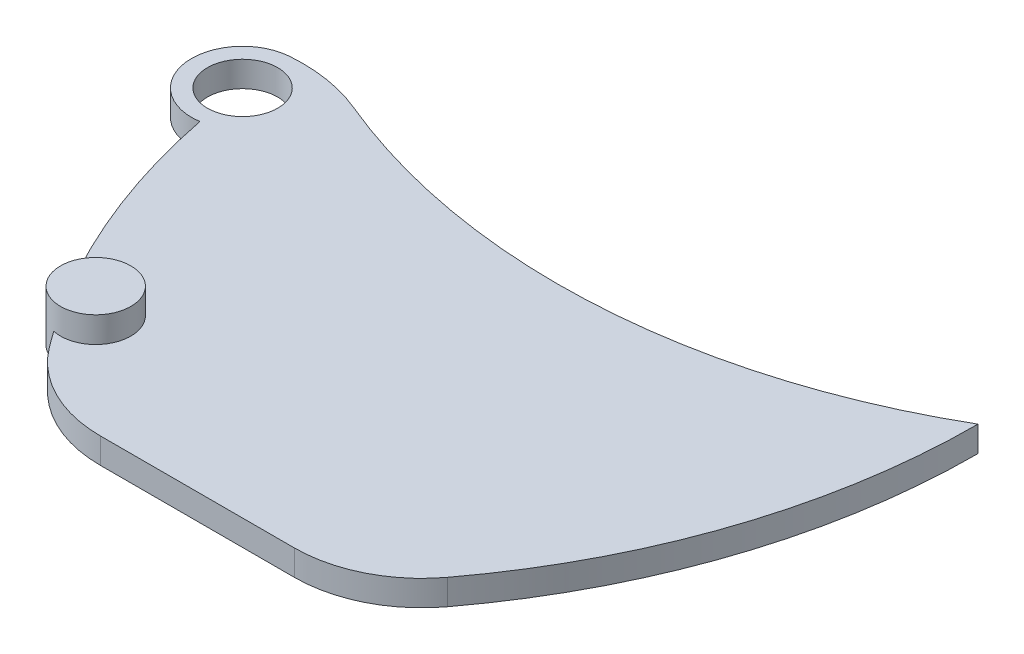
ISO-10303-21;
HEADER;
FILE_DESCRIPTION(('STEP AP214'),'2;1');
FILE_NAME('part.step','',(''),(''),'','','');
FILE_SCHEMA(('AUTOMOTIVE_DESIGN { 1 0 10303 214 1 1 1 1 }'));
ENDSEC;
DATA;
#1=APPLICATION_CONTEXT('core data for automotive mechanical design processes');
#2=APPLICATION_PROTOCOL_DEFINITION('international standard','automotive_design',2000,#1);
#3=PRODUCT_CONTEXT('',#1,'mechanical');
#4=PRODUCT('Part','Part','',(#3));
#5=PRODUCT_RELATED_PRODUCT_CATEGORY('part','',(#4));
#6=PRODUCT_DEFINITION_FORMATION('','',#4);
#7=PRODUCT_DEFINITION_CONTEXT('part definition',#1,'design');
#8=PRODUCT_DEFINITION('design','',#6,#7);
#9=PRODUCT_DEFINITION_SHAPE('','',#8);
#10=(LENGTH_UNIT() NAMED_UNIT(*) SI_UNIT(.MILLI.,.METRE.));
#11=(NAMED_UNIT(*) PLANE_ANGLE_UNIT() SI_UNIT($,.RADIAN.));
#12=(NAMED_UNIT(*) SI_UNIT($,.STERADIAN.) SOLID_ANGLE_UNIT());
#13=UNCERTAINTY_MEASURE_WITH_UNIT(LENGTH_MEASURE(1.E-05),#10,'distance_accuracy_value','');
#14=(GEOMETRIC_REPRESENTATION_CONTEXT(3) GLOBAL_UNCERTAINTY_ASSIGNED_CONTEXT((#13)) GLOBAL_UNIT_ASSIGNED_CONTEXT((#10,
#11,#12)) REPRESENTATION_CONTEXT('',''));
#15=CARTESIAN_POINT('',(0.,0.,0.));
#16=DIRECTION('',(0.,0.,1.));
#17=DIRECTION('',(1.,0.,0.));
#18=AXIS2_PLACEMENT_3D('',#15,#16,#17);
#19=CARTESIAN_POINT('',(-50.6401802951426,3.0625,34.9645397855492));
#20=DIRECTION('',(0.,-1.,0.));
#21=DIRECTION('',(0.,0.,-1.));
#22=AXIS2_PLACEMENT_3D('',#19,#20,#21);
#23=CYLINDRICAL_SURFACE('',#22,29.25);
#24=CARTESIAN_POINT('',(-50.6401802951426,1.9375,34.9645397855492));
#25=DIRECTION('',(0.,1.,0.));
#26=DIRECTION('',(0.,0.,1.));
#27=AXIS2_PLACEMENT_3D('',#24,#25,#26);
#28=CIRCLE('',#27,29.25);
#29=CARTESIAN_POINT('',(-79.3494325759984,1.9375,40.5628728833721));
#30=VERTEX_POINT('',#29);
#31=CARTESIAN_POINT('',(-75.7464598901376,1.9375,49.9724451989618));
#32=VERTEX_POINT('',#31);
#33=EDGE_CURVE('E127',#30,#32,#28,.T.);
#34=ORIENTED_EDGE('',*,*,#33,.T.);
#35=DIRECTION('',(0.,-1.,0.));
#36=VECTOR('',#35,1.);
#37=CARTESIAN_POINT('',(-75.7464598901376,3.0675,49.9724451989619));
#38=LINE('',#37,#36);
#39=CARTESIAN_POINT('',(-75.7464598901376,3.0625,49.9724451989619));
#40=VERTEX_POINT('',#39);
#41=EDGE_CURVE('E12',#32,#40,#38,.F.);
#42=ORIENTED_EDGE('',*,*,#41,.T.);
#43=CARTESIAN_POINT('',(-50.6401802951426,3.0625,34.9645397855492));
#44=DIRECTION('',(0.,1.,0.));
#45=DIRECTION('',(0.,0.,1.));
#46=AXIS2_PLACEMENT_3D('',#43,#44,#45);
#47=CIRCLE('',#46,29.25);
#48=CARTESIAN_POINT('',(-79.3494325759984,3.0625,40.5628728833721));
#49=VERTEX_POINT('',#48);
#50=EDGE_CURVE('E167',#49,#40,#47,.T.);
#51=ORIENTED_EDGE('',*,*,#50,.F.);
#52=DIRECTION('',(0.,-1.,0.));
#53=VECTOR('',#52,1.);
#54=CARTESIAN_POINT('',(-79.3494325759984,3.0625,40.5628728833721));
#55=LINE('',#54,#53);
#56=EDGE_CURVE('E169',#49,#30,#55,.T.);
#57=ORIENTED_EDGE('',*,*,#56,.T.);
#58=EDGE_LOOP('',(#34,#42,#51,#57));
#59=FACE_BOUND('',#58,.T.);
#60=ADVANCED_FACE('F39',(#59),#23,.T.);
#61=CARTESIAN_POINT('',(-72.5776802951426,3.0625,22.2989182552017));
#62=DIRECTION('',(0.,1.,0.));
#63=DIRECTION('',(0.,0.,1.));
#64=AXIS2_PLACEMENT_3D('',#61,#62,#63);
#65=PLANE('',#64);
#66=CARTESIAN_POINT('',(-74.2277900186078,3.0625,50.2825126453467));
#67=DIRECTION('',(0.,1.,0.));
#68=DIRECTION('',(0.,0.,1.));
#69=AXIS2_PLACEMENT_3D('',#66,#67,#68);
#70=CIRCLE('',#69,1.54999999999999);
#71=CARTESIAN_POINT('',(-74.5622279968865,3.0625,51.796002400411));
#72=VERTEX_POINT('',#71);
#73=EDGE_CURVE('E54',#72,#40,#70,.T.);
#74=ORIENTED_EDGE('',*,*,#73,.F.);
#75=CARTESIAN_POINT('',(-74.0401802951426,3.0625,52.5145397855492));
#76=VERTEX_POINT('',#75);
#77=EDGE_CURVE('E132',#72,#76,#47,.T.);
#78=ORIENTED_EDGE('',*,*,#77,.T.);
#79=CARTESIAN_POINT('',(-69.5401802951426,3.0625,49.1395397855492));
#80=DIRECTION('',(0.,1.,0.));
#81=DIRECTION('',(0.,0.,1.));
#82=AXIS2_PLACEMENT_3D('',#79,#80,#81);
#83=CIRCLE('',#82,5.625);
#84=CARTESIAN_POINT('',(-69.5401802951426,3.0625,54.7645397855492));
#85=VERTEX_POINT('',#84);
#86=EDGE_CURVE('E191',#76,#85,#83,.T.);
#87=ORIENTED_EDGE('',*,*,#86,.T.);
#88=DIRECTION('',(1.,0.,0.));
#89=VECTOR('',#88,1.);
#90=CARTESIAN_POINT('',(-50.6401802951426,3.0625,54.7645397855492));
#91=LINE('',#90,#89);
#92=CARTESIAN_POINT('',(-60.9901802951427,3.0625,54.7645397855492));
#93=VERTEX_POINT('',#92);
#94=EDGE_CURVE('E156',#85,#93,#91,.T.);
#95=ORIENTED_EDGE('',*,*,#94,.T.);
#96=CARTESIAN_POINT('',(-60.9901802951427,3.0625,49.1395397855492));
#97=DIRECTION('',(0.,1.,0.));
#98=DIRECTION('',(0.,0.,1.));
#99=AXIS2_PLACEMENT_3D('',#96,#97,#98);
#100=CIRCLE('',#99,5.625);
#101=CARTESIAN_POINT('',(-56.4901802951428,3.0625,52.5145397855492));
#102=VERTEX_POINT('',#101);
#103=EDGE_CURVE('E193',#93,#102,#100,.T.);
#104=ORIENTED_EDGE('',*,*,#103,.T.);
#105=CARTESIAN_POINT('',(-79.8901802951426,3.0625,34.964539785549));
#106=DIRECTION('',(0.,1.,0.));
#107=DIRECTION('',(0.,0.,1.));
#108=AXIS2_PLACEMENT_3D('',#105,#106,#107);
#109=CIRCLE('',#108,29.25);
#110=CARTESIAN_POINT('',(-50.6401802951426,3.0625,34.9645397855492));
#111=VERTEX_POINT('',#110);
#112=EDGE_CURVE('E160',#102,#111,#109,.T.);
#113=ORIENTED_EDGE('',*,*,#112,.T.);
#114=CARTESIAN_POINT('',(-65.2651802951426,3.0625,9.63329672485436));
#115=DIRECTION('',(0.,-1.,0.));
#116=DIRECTION('',(0.,0.,1.));
#117=AXIS2_PLACEMENT_3D('',#114,#115,#116);
#118=CIRCLE('',#117,29.25);
#119=CARTESIAN_POINT('',(-76.5152819974136,3.0625,36.6332543486833));
#120=VERTEX_POINT('',#119);
#121=EDGE_CURVE('E162',#111,#120,#118,.T.);
#122=ORIENTED_EDGE('',*,*,#121,.T.);
#123=CARTESIAN_POINT('',(-79.3084125514225,3.0625,43.3366965567514));
#124=DIRECTION('',(0.,1.,0.));
#125=DIRECTION('',(0.,0.,1.));
#126=AXIS2_PLACEMENT_3D('',#123,#124,#125);
#127=CIRCLE('',#126,7.26207378981012);
#128=CARTESIAN_POINT('',(-79.8682791566681,3.0625,36.0962362735251));
#129=VERTEX_POINT('',#128);
#130=EDGE_CURVE('E148',#129,#120,#127,.F.);
#131=ORIENTED_EDGE('',*,*,#130,.F.);
#132=CARTESIAN_POINT('',(-79.6948163279688,3.0625,38.3395397855492));
#133=DIRECTION('',(0.,1.,0.));
#134=DIRECTION('',(0.,0.,1.));
#135=AXIS2_PLACEMENT_3D('',#132,#133,#134);
#136=CIRCLE('',#135,2.25);
#137=EDGE_CURVE('E165',#129,#49,#136,.T.);
#138=ORIENTED_EDGE('',*,*,#137,.T.);
#139=ORIENTED_EDGE('',*,*,#50,.T.);
#140=EDGE_LOOP('',(#74,#78,#87,#95,#104,#113,#122,#131,#138,#139));
#141=FACE_BOUND('',#140,.T.);
#142=CARTESIAN_POINT('',(-79.6948163279688,3.0625,38.3395397855492));
#143=DIRECTION('',(0.,1.,0.));
#144=DIRECTION('',(0.,0.,1.));
#145=AXIS2_PLACEMENT_3D('',#142,#143,#144);
#146=CIRCLE('',#145,1.54999999999999);
#147=CARTESIAN_POINT('',(-79.6948163279688,3.0625,39.8895397855492));
#148=VERTEX_POINT('',#147);
#149=EDGE_CURVE('E142',#148,#148,#146,.T.);
#150=ORIENTED_EDGE('',*,*,#149,.F.);
#151=EDGE_LOOP('',(#150));
#152=FACE_BOUND('',#151,.T.);
#153=ADVANCED_FACE('F204',(#141,#152),#65,.T.);
#154=CARTESIAN_POINT('',(-72.5776802951426,1.9375,22.2989182552017));
#155=DIRECTION('',(0.,1.,0.));
#156=DIRECTION('',(0.,0.,1.));
#157=AXIS2_PLACEMENT_3D('',#154,#155,#156);
#158=PLANE('',#157);
#159=CARTESIAN_POINT('',(-79.6948163279688,1.9375,38.3395397855492));
#160=DIRECTION('',(0.,1.,0.));
#161=DIRECTION('',(0.,0.,1.));
#162=AXIS2_PLACEMENT_3D('',#159,#160,#161);
#163=CIRCLE('',#162,1.54999999999999);
#164=CARTESIAN_POINT('',(-79.6948163279688,1.9375,39.8895397855492));
#165=VERTEX_POINT('',#164);
#166=EDGE_CURVE('E145',#165,#165,#163,.F.);
#167=ORIENTED_EDGE('',*,*,#166,.F.);
#168=EDGE_LOOP('',(#167));
#169=FACE_BOUND('',#168,.T.);
#170=CARTESIAN_POINT('',(-74.5622279968865,1.9375,51.7960024004111));
#171=VERTEX_POINT('',#170);
#172=CARTESIAN_POINT('',(-74.0401802951426,1.9375,52.5145397855492));
#173=VERTEX_POINT('',#172);
#174=EDGE_CURVE('E115',#171,#173,#28,.T.);
#175=ORIENTED_EDGE('',*,*,#174,.F.);
#176=CARTESIAN_POINT('',(-74.2277900186078,1.9375,50.2825126453467));
#177=DIRECTION('',(0.,-1.,0.));
#178=DIRECTION('',(0.,0.,-1.));
#179=AXIS2_PLACEMENT_3D('',#176,#177,#178);
#180=CIRCLE('',#179,1.54999999999999);
#181=EDGE_CURVE('E120',#171,#32,#180,.T.);
#182=ORIENTED_EDGE('',*,*,#181,.T.);
#183=ORIENTED_EDGE('',*,*,#33,.F.);
#184=CARTESIAN_POINT('',(-79.6948163279688,1.9375,38.3395397855492));
#185=DIRECTION('',(0.,1.,0.));
#186=DIRECTION('',(0.,0.,1.));
#187=AXIS2_PLACEMENT_3D('',#184,#185,#186);
#188=CIRCLE('',#187,2.25);
#189=CARTESIAN_POINT('',(-79.8682791566681,1.9375,36.0962362735251));
#190=VERTEX_POINT('',#189);
#191=EDGE_CURVE('E128',#190,#30,#188,.T.);
#192=ORIENTED_EDGE('',*,*,#191,.F.);
#193=CARTESIAN_POINT('',(-79.3084125514225,1.9375,43.3366965567514));
#194=DIRECTION('',(0.,1.,0.));
#195=DIRECTION('',(0.,0.,1.));
#196=AXIS2_PLACEMENT_3D('',#193,#194,#195);
#197=CIRCLE('',#196,7.26207378981012);
#198=CARTESIAN_POINT('',(-76.5152819974136,1.9375,36.6332543486833));
#199=VERTEX_POINT('',#198);
#200=EDGE_CURVE('E153',#190,#199,#197,.F.);
#201=ORIENTED_EDGE('',*,*,#200,.T.);
#202=CARTESIAN_POINT('',(-65.2651802951426,1.9375,9.63329672485436));
#203=DIRECTION('',(0.,-1.,0.));
#204=DIRECTION('',(0.,0.,1.));
#205=AXIS2_PLACEMENT_3D('',#202,#203,#204);
#206=CIRCLE('',#205,29.25);
#207=CARTESIAN_POINT('',(-50.6401802951426,1.9375,34.9645397855492));
#208=VERTEX_POINT('',#207);
#209=EDGE_CURVE('E171',#208,#199,#206,.T.);
#210=ORIENTED_EDGE('',*,*,#209,.F.);
#211=CARTESIAN_POINT('',(-79.8901802951426,1.9375,34.964539785549));
#212=DIRECTION('',(0.,1.,0.));
#213=DIRECTION('',(0.,0.,1.));
#214=AXIS2_PLACEMENT_3D('',#211,#212,#213);
#215=CIRCLE('',#214,29.25);
#216=CARTESIAN_POINT('',(-56.4901802951428,1.9375,52.5145397855492));
#217=VERTEX_POINT('',#216);
#218=EDGE_CURVE('E159',#217,#208,#215,.T.);
#219=ORIENTED_EDGE('',*,*,#218,.F.);
#220=CARTESIAN_POINT('',(-60.9901802951427,1.9375,49.1395397855492));
#221=DIRECTION('',(0.,1.,0.));
#222=DIRECTION('',(0.,0.,1.));
#223=AXIS2_PLACEMENT_3D('',#220,#221,#222);
#224=CIRCLE('',#223,5.625);
#225=CARTESIAN_POINT('',(-60.9901802951427,1.9375,54.7645397855492));
#226=VERTEX_POINT('',#225);
#227=EDGE_CURVE('E198',#217,#226,#224,.F.);
#228=ORIENTED_EDGE('',*,*,#227,.T.);
#229=DIRECTION('',(1.,0.,0.));
#230=VECTOR('',#229,1.);
#231=CARTESIAN_POINT('',(-72.5776802951426,1.9375,54.7645397855492));
#232=LINE('',#231,#230);
#233=CARTESIAN_POINT('',(-69.5401802951426,1.9375,54.7645397855492));
#234=VERTEX_POINT('',#233);
#235=EDGE_CURVE('E183',#234,#226,#232,.T.);
#236=ORIENTED_EDGE('',*,*,#235,.F.);
#237=CARTESIAN_POINT('',(-69.5401802951426,1.9375,49.1395397855492));
#238=DIRECTION('',(0.,1.,0.));
#239=DIRECTION('',(0.,0.,1.));
#240=AXIS2_PLACEMENT_3D('',#237,#238,#239);
#241=CIRCLE('',#240,5.625);
#242=EDGE_CURVE('E123',#234,#173,#241,.F.);
#243=ORIENTED_EDGE('',*,*,#242,.T.);
#244=EDGE_LOOP('',(#175,#182,#183,#192,#201,#210,#219,#228,#236,#243));
#245=FACE_BOUND('',#244,.T.);
#246=ADVANCED_FACE('F117',(#169,#245),#158,.F.);
#247=CARTESIAN_POINT('',(-79.8901802951426,3.0625,34.964539785549));
#248=DIRECTION('',(0.,-1.,0.));
#249=DIRECTION('',(0.,0.,-1.));
#250=AXIS2_PLACEMENT_3D('',#247,#248,#249);
#251=CYLINDRICAL_SURFACE('',#250,29.25);
#252=ORIENTED_EDGE('',*,*,#112,.F.);
#253=DIRECTION('',(0.,-1.,0.));
#254=VECTOR('',#253,1.);
#255=CARTESIAN_POINT('',(-56.4901802951428,3.0625,52.5145397855492));
#256=LINE('',#255,#254);
#257=EDGE_CURVE('E195',#102,#217,#256,.T.);
#258=ORIENTED_EDGE('',*,*,#257,.T.);
#259=ORIENTED_EDGE('',*,*,#218,.T.);
#260=DIRECTION('',(0.,-1.,0.));
#261=VECTOR('',#260,1.);
#262=CARTESIAN_POINT('',(-50.6401802951426,3.0625,34.9645397855492));
#263=LINE('',#262,#261);
#264=EDGE_CURVE('E180',#111,#208,#263,.T.);
#265=ORIENTED_EDGE('',*,*,#264,.F.);
#266=EDGE_LOOP('',(#252,#258,#259,#265));
#267=FACE_BOUND('',#266,.T.);
#268=ADVANCED_FACE('F217',(#267),#251,.T.);
#269=ORIENTED_EDGE('',*,*,#77,.F.);
#270=DIRECTION('',(0.,-1.,0.));
#271=VECTOR('',#270,1.);
#272=CARTESIAN_POINT('',(-74.5622279968865,3.0675,51.7960024004111));
#273=LINE('',#272,#271);
#274=EDGE_CURVE('E47',#72,#171,#273,.T.);
#275=ORIENTED_EDGE('',*,*,#274,.T.);
#276=ORIENTED_EDGE('',*,*,#174,.T.);
#277=DIRECTION('',(0.,-1.,0.));
#278=VECTOR('',#277,1.);
#279=CARTESIAN_POINT('',(-74.0401802951426,3.0625,52.5145397855492));
#280=LINE('',#279,#278);
#281=EDGE_CURVE('E134',#173,#76,#280,.F.);
#282=ORIENTED_EDGE('',*,*,#281,.T.);
#283=EDGE_LOOP('',(#269,#275,#276,#282));
#284=FACE_BOUND('',#283,.T.);
#285=ADVANCED_FACE('F131',(#284),#23,.T.);
#286=CARTESIAN_POINT('',(-65.2651802951426,3.0625,9.63329672485436));
#287=DIRECTION('',(0.,-1.,0.));
#288=DIRECTION('',(0.,0.,-1.));
#289=AXIS2_PLACEMENT_3D('',#286,#287,#288);
#290=CYLINDRICAL_SURFACE('',#289,29.25);
#291=ORIENTED_EDGE('',*,*,#209,.T.);
#292=DIRECTION('',(0.,1.,0.));
#293=VECTOR('',#292,1.);
#294=CARTESIAN_POINT('',(-76.5152819974136,-2.5625,36.6332543486833));
#295=LINE('',#294,#293);
#296=EDGE_CURVE('E150',#199,#120,#295,.T.);
#297=ORIENTED_EDGE('',*,*,#296,.T.);
#298=ORIENTED_EDGE('',*,*,#121,.F.);
#299=ORIENTED_EDGE('',*,*,#264,.T.);
#300=EDGE_LOOP('',(#291,#297,#298,#299));
#301=FACE_BOUND('',#300,.T.);
#302=ADVANCED_FACE('F221',(#301),#290,.F.);
#303=CARTESIAN_POINT('',(-79.6948163279688,3.0625,38.3395397855492));
#304=DIRECTION('',(0.,-1.,0.));
#305=DIRECTION('',(0.,0.,-1.));
#306=AXIS2_PLACEMENT_3D('',#303,#304,#305);
#307=CYLINDRICAL_SURFACE('',#306,2.25);
#308=ORIENTED_EDGE('',*,*,#191,.T.);
#309=ORIENTED_EDGE('',*,*,#56,.F.);
#310=ORIENTED_EDGE('',*,*,#137,.F.);
#311=DIRECTION('',(0.,-1.,0.));
#312=VECTOR('',#311,1.);
#313=CARTESIAN_POINT('',(-79.8682791566681,3.0625,36.0962362735251));
#314=LINE('',#313,#312);
#315=EDGE_CURVE('E177',#129,#190,#314,.T.);
#316=ORIENTED_EDGE('',*,*,#315,.T.);
#317=EDGE_LOOP('',(#308,#309,#310,#316));
#318=FACE_BOUND('',#317,.T.);
#319=ADVANCED_FACE('F227',(#318),#307,.T.);
#320=CARTESIAN_POINT('',(-50.6401802951426,-2.5625,54.7645397855492));
#321=DIRECTION('',(0.,0.,1.));
#322=DIRECTION('',(1.,0.,0.));
#323=AXIS2_PLACEMENT_3D('',#320,#321,#322);
#324=PLANE('',#323);
#325=ORIENTED_EDGE('',*,*,#235,.T.);
#326=DIRECTION('',(0.,1.,0.));
#327=VECTOR('',#326,1.);
#328=CARTESIAN_POINT('',(-60.9901802951427,3.0625,54.7645397855492));
#329=LINE('',#328,#327);
#330=EDGE_CURVE('E188',#226,#93,#329,.T.);
#331=ORIENTED_EDGE('',*,*,#330,.T.);
#332=ORIENTED_EDGE('',*,*,#94,.F.);
#333=DIRECTION('',(0.,1.,0.));
#334=VECTOR('',#333,1.);
#335=CARTESIAN_POINT('',(-69.5401802951426,1.9375,54.7645397855492));
#336=LINE('',#335,#334);
#337=EDGE_CURVE('E186',#85,#234,#336,.F.);
#338=ORIENTED_EDGE('',*,*,#337,.T.);
#339=EDGE_LOOP('',(#325,#331,#332,#338));
#340=FACE_BOUND('',#339,.T.);
#341=ADVANCED_FACE('F207',(#340),#324,.T.);
#342=CARTESIAN_POINT('',(-79.3084125514225,-2.5625,43.3366965567514));
#343=DIRECTION('',(0.,1.,0.));
#344=DIRECTION('',(0.,0.,1.));
#345=AXIS2_PLACEMENT_3D('',#342,#343,#344);
#346=CYLINDRICAL_SURFACE('',#345,7.26207378981012);
#347=ORIENTED_EDGE('',*,*,#315,.F.);
#348=ORIENTED_EDGE('',*,*,#130,.T.);
#349=ORIENTED_EDGE('',*,*,#296,.F.);
#350=ORIENTED_EDGE('',*,*,#200,.F.);
#351=EDGE_LOOP('',(#347,#348,#349,#350));
#352=FACE_BOUND('',#351,.T.);
#353=ADVANCED_FACE('F249',(#352),#346,.T.);
#354=CARTESIAN_POINT('',(-60.9901802951427,3.0625,49.1395397855492));
#355=DIRECTION('',(0.,-1.,0.));
#356=DIRECTION('',(0.,0.,-1.));
#357=AXIS2_PLACEMENT_3D('',#354,#355,#356);
#358=CYLINDRICAL_SURFACE('',#357,5.625);
#359=ORIENTED_EDGE('',*,*,#227,.F.);
#360=ORIENTED_EDGE('',*,*,#257,.F.);
#361=ORIENTED_EDGE('',*,*,#103,.F.);
#362=ORIENTED_EDGE('',*,*,#330,.F.);
#363=EDGE_LOOP('',(#359,#360,#361,#362));
#364=FACE_BOUND('',#363,.T.);
#365=ADVANCED_FACE('F211',(#364),#358,.T.);
#366=CARTESIAN_POINT('',(-69.5401802951426,3.0625,49.1395397855492));
#367=DIRECTION('',(0.,-1.,0.));
#368=DIRECTION('',(0.,0.,-1.));
#369=AXIS2_PLACEMENT_3D('',#366,#367,#368);
#370=CYLINDRICAL_SURFACE('',#369,5.625);
#371=ORIENTED_EDGE('',*,*,#242,.F.);
#372=ORIENTED_EDGE('',*,*,#337,.F.);
#373=ORIENTED_EDGE('',*,*,#86,.F.);
#374=ORIENTED_EDGE('',*,*,#281,.F.);
#375=EDGE_LOOP('',(#371,#372,#373,#374));
#376=FACE_BOUND('',#375,.T.);
#377=ADVANCED_FACE('F41',(#376),#370,.T.);
#378=CARTESIAN_POINT('',(-79.6948163279688,1.9365,38.3395397855492));
#379=DIRECTION('',(0.,1.,0.));
#380=DIRECTION('',(0.,0.,1.));
#381=AXIS2_PLACEMENT_3D('',#378,#379,#380);
#382=CYLINDRICAL_SURFACE('',#381,1.54999999999999);
#383=ORIENTED_EDGE('',*,*,#149,.T.);
#384=EDGE_LOOP('',(#383));
#385=FACE_BOUND('',#384,.T.);
#386=ORIENTED_EDGE('',*,*,#166,.T.);
#387=EDGE_LOOP('',(#386));
#388=FACE_BOUND('',#387,.T.);
#389=ADVANCED_FACE('F254',(#385,#388),#382,.F.);
#390=CARTESIAN_POINT('',(-74.2277900186078,4.1975,50.2825126453467));
#391=DIRECTION('',(0.,-1.,0.));
#392=DIRECTION('',(0.,0.,-1.));
#393=AXIS2_PLACEMENT_3D('',#390,#391,#392);
#394=CYLINDRICAL_SURFACE('',#393,1.54999999999999);
#395=CARTESIAN_POINT('',(-74.2277900186078,4.1975,50.2825126453467));
#396=DIRECTION('',(0.,-1.,0.));
#397=DIRECTION('',(0.,0.,-1.));
#398=AXIS2_PLACEMENT_3D('',#395,#396,#397);
#399=CIRCLE('',#398,1.54999999999999);
#400=CARTESIAN_POINT('',(-74.2277900186078,4.1975,48.7325126453467));
#401=VERTEX_POINT('',#400);
#402=EDGE_CURVE('E136',#401,#401,#399,.T.);
#403=ORIENTED_EDGE('',*,*,#402,.T.);
#404=EDGE_LOOP('',(#403));
#405=FACE_BOUND('',#404,.T.);
#406=ORIENTED_EDGE('',*,*,#41,.F.);
#407=ORIENTED_EDGE('',*,*,#181,.F.);
#408=ORIENTED_EDGE('',*,*,#274,.F.);
#409=ORIENTED_EDGE('',*,*,#73,.T.);
#410=EDGE_LOOP('',(#406,#407,#408,#409));
#411=FACE_BOUND('',#410,.T.);
#412=ADVANCED_FACE('F135',(#405,#411),#394,.T.);
#413=CARTESIAN_POINT('',(-74.2277900186078,4.1975,50.2825126453467));
#414=DIRECTION('',(0.,-1.,0.));
#415=DIRECTION('',(0.,0.,-1.));
#416=AXIS2_PLACEMENT_3D('',#413,#414,#415);
#417=PLANE('',#416);
#418=ORIENTED_EDGE('',*,*,#402,.F.);
#419=EDGE_LOOP('',(#418));
#420=FACE_BOUND('',#419,.T.);
#421=ADVANCED_FACE('F266',(#420),#417,.F.);
#422=CLOSED_SHELL('',(#60,#153,#246,#268,#285,#302,#319,#341,#353,#365,#377,#389,#412,#421));
#423=MANIFOLD_SOLID_BREP('B2',#422);
#424=ADVANCED_BREP_SHAPE_REPRESENTATION('',(#18,#423),#14);
#425=SHAPE_DEFINITION_REPRESENTATION(#9,#424);
ENDSEC;
END-ISO-10303-21;
